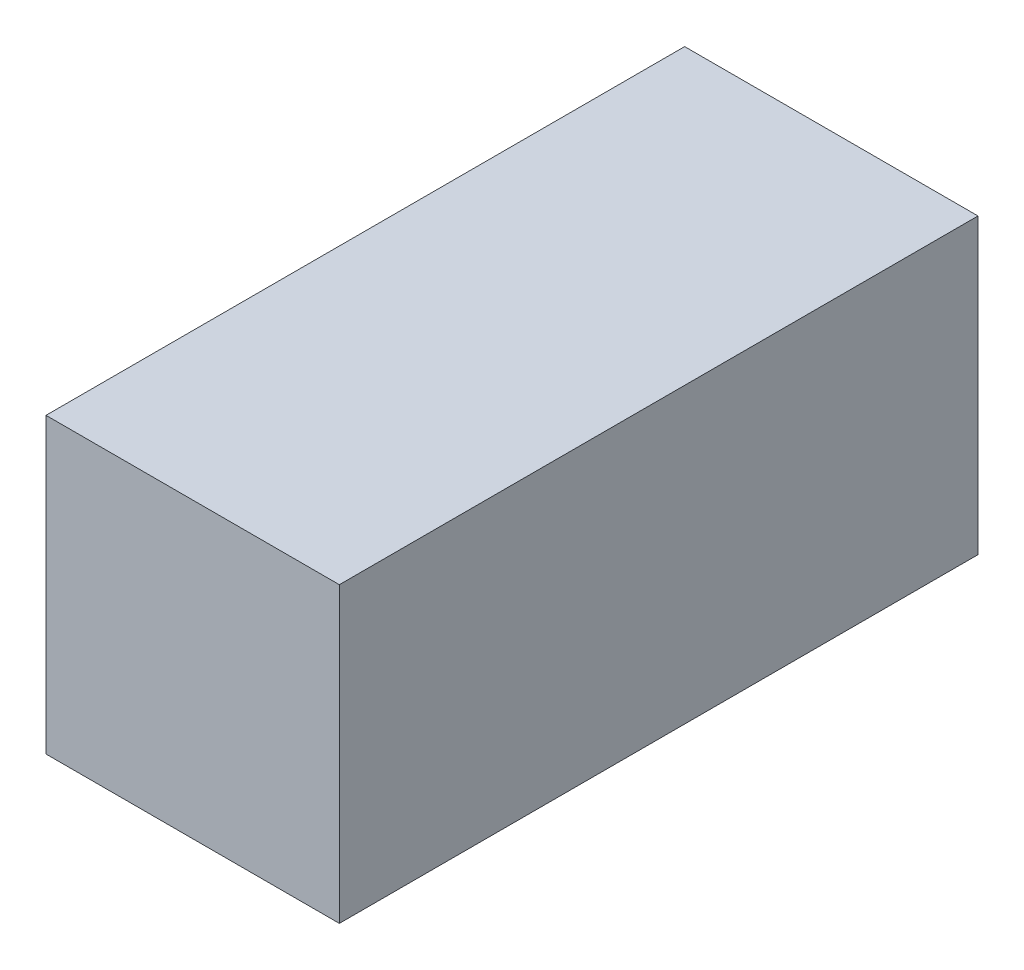
ISO-10303-21;
HEADER;
FILE_DESCRIPTION(('STEP AP214'),'2;1');
FILE_NAME('part.step','',(''),(''),'','','');
FILE_SCHEMA(('AUTOMOTIVE_DESIGN { 1 0 10303 214 1 1 1 1 }'));
ENDSEC;
DATA;
#1=APPLICATION_CONTEXT('core data for automotive mechanical design processes');
#2=APPLICATION_PROTOCOL_DEFINITION('international standard','automotive_design',2000,#1);
#3=PRODUCT_CONTEXT('',#1,'mechanical');
#4=PRODUCT('Part','Part','',(#3));
#5=PRODUCT_RELATED_PRODUCT_CATEGORY('part','',(#4));
#6=PRODUCT_DEFINITION_FORMATION('','',#4);
#7=PRODUCT_DEFINITION_CONTEXT('part definition',#1,'design');
#8=PRODUCT_DEFINITION('design','',#6,#7);
#9=PRODUCT_DEFINITION_SHAPE('','',#8);
#10=(LENGTH_UNIT() NAMED_UNIT(*) SI_UNIT(.MILLI.,.METRE.));
#11=(NAMED_UNIT(*) PLANE_ANGLE_UNIT() SI_UNIT($,.RADIAN.));
#12=(NAMED_UNIT(*) SI_UNIT($,.STERADIAN.) SOLID_ANGLE_UNIT());
#13=UNCERTAINTY_MEASURE_WITH_UNIT(LENGTH_MEASURE(1.E-05),#10,'distance_accuracy_value','');
#14=(GEOMETRIC_REPRESENTATION_CONTEXT(3) GLOBAL_UNCERTAINTY_ASSIGNED_CONTEXT((#13)) GLOBAL_UNIT_ASSIGNED_CONTEXT((#10,
#11,#12)) REPRESENTATION_CONTEXT('',''));
#15=CARTESIAN_POINT('',(0.,0.,0.));
#16=DIRECTION('',(0.,0.,1.));
#17=DIRECTION('',(1.,0.,0.));
#18=AXIS2_PLACEMENT_3D('',#15,#16,#17);
#19=CARTESIAN_POINT('',(0.,0.,76.2));
#20=DIRECTION('',(1.,0.,0.));
#21=DIRECTION('',(0.,1.,0.));
#22=AXIS2_PLACEMENT_3D('',#19,#20,#21);
#23=PLANE('',#22);
#24=DIRECTION('',(0.,-1.,0.));
#25=VECTOR('',#24,1.);
#26=CARTESIAN_POINT('',(0.,0.,0.));
#27=LINE('',#26,#25);
#28=CARTESIAN_POINT('',(0.,35.,0.));
#29=VERTEX_POINT('',#28);
#30=CARTESIAN_POINT('',(0.,0.,0.));
#31=VERTEX_POINT('',#30);
#32=EDGE_CURVE('E96',#29,#31,#27,.T.);
#33=ORIENTED_EDGE('',*,*,#32,.T.);
#34=DIRECTION('',(0.,0.,-1.));
#35=VECTOR('',#34,1.);
#36=CARTESIAN_POINT('',(0.,0.,76.2));
#37=LINE('',#36,#35);
#38=CARTESIAN_POINT('',(0.,0.,76.2));
#39=VERTEX_POINT('',#38);
#40=EDGE_CURVE('E11',#39,#31,#37,.T.);
#41=ORIENTED_EDGE('',*,*,#40,.F.);
#42=DIRECTION('',(0.,-1.,0.));
#43=VECTOR('',#42,1.);
#44=CARTESIAN_POINT('',(0.,0.,76.2));
#45=LINE('',#44,#43);
#46=CARTESIAN_POINT('',(0.,35.,76.2));
#47=VERTEX_POINT('',#46);
#48=EDGE_CURVE('E84',#47,#39,#45,.T.);
#49=ORIENTED_EDGE('',*,*,#48,.F.);
#50=DIRECTION('',(0.,0.,-1.));
#51=VECTOR('',#50,1.);
#52=CARTESIAN_POINT('',(0.,35.,76.2));
#53=LINE('',#52,#51);
#54=EDGE_CURVE('E92',#47,#29,#53,.T.);
#55=ORIENTED_EDGE('',*,*,#54,.T.);
#56=EDGE_LOOP('',(#33,#41,#49,#55));
#57=FACE_BOUND('',#56,.T.);
#58=ADVANCED_FACE('F33',(#57),#23,.F.);
#59=CARTESIAN_POINT('',(0.,0.,76.2));
#60=DIRECTION('',(0.,1.,0.));
#61=DIRECTION('',(0.,0.,1.));
#62=AXIS2_PLACEMENT_3D('',#59,#60,#61);
#63=PLANE('',#62);
#64=DIRECTION('',(1.,0.,0.));
#65=VECTOR('',#64,1.);
#66=CARTESIAN_POINT('',(0.,0.,0.));
#67=LINE('',#66,#65);
#68=CARTESIAN_POINT('',(35.,0.,0.));
#69=VERTEX_POINT('',#68);
#70=EDGE_CURVE('E88',#31,#69,#67,.T.);
#71=ORIENTED_EDGE('',*,*,#70,.T.);
#72=DIRECTION('',(0.,0.,-1.));
#73=VECTOR('',#72,1.);
#74=CARTESIAN_POINT('',(35.,0.,76.2));
#75=LINE('',#74,#73);
#76=CARTESIAN_POINT('',(35.,0.,76.2));
#77=VERTEX_POINT('',#76);
#78=EDGE_CURVE('E41',#77,#69,#75,.T.);
#79=ORIENTED_EDGE('',*,*,#78,.F.);
#80=DIRECTION('',(1.,0.,0.));
#81=VECTOR('',#80,1.);
#82=CARTESIAN_POINT('',(0.,0.,76.2));
#83=LINE('',#82,#81);
#84=EDGE_CURVE('E79',#39,#77,#83,.T.);
#85=ORIENTED_EDGE('',*,*,#84,.F.);
#86=ORIENTED_EDGE('',*,*,#40,.T.);
#87=EDGE_LOOP('',(#71,#79,#85,#86));
#88=FACE_BOUND('',#87,.T.);
#89=ADVANCED_FACE('F87',(#88),#63,.F.);
#90=CARTESIAN_POINT('',(35.,0.,76.2));
#91=DIRECTION('',(-1.,0.,0.));
#92=DIRECTION('',(0.,-1.,0.));
#93=AXIS2_PLACEMENT_3D('',#90,#91,#92);
#94=PLANE('',#93);
#95=DIRECTION('',(0.,1.,0.));
#96=VECTOR('',#95,1.);
#97=CARTESIAN_POINT('',(35.,0.,0.));
#98=LINE('',#97,#96);
#99=CARTESIAN_POINT('',(35.,35.,0.));
#100=VERTEX_POINT('',#99);
#101=EDGE_CURVE('E66',#69,#100,#98,.T.);
#102=ORIENTED_EDGE('',*,*,#101,.T.);
#103=DIRECTION('',(0.,0.,-1.));
#104=VECTOR('',#103,1.);
#105=CARTESIAN_POINT('',(35.,35.,76.2));
#106=LINE('',#105,#104);
#107=CARTESIAN_POINT('',(35.,35.,76.2));
#108=VERTEX_POINT('',#107);
#109=EDGE_CURVE('E89',#108,#100,#106,.T.);
#110=ORIENTED_EDGE('',*,*,#109,.F.);
#111=DIRECTION('',(0.,1.,0.));
#112=VECTOR('',#111,1.);
#113=CARTESIAN_POINT('',(35.,0.,76.2));
#114=LINE('',#113,#112);
#115=EDGE_CURVE('E82',#77,#108,#114,.T.);
#116=ORIENTED_EDGE('',*,*,#115,.F.);
#117=ORIENTED_EDGE('',*,*,#78,.T.);
#118=EDGE_LOOP('',(#102,#110,#116,#117));
#119=FACE_BOUND('',#118,.T.);
#120=ADVANCED_FACE('F90',(#119),#94,.F.);
#121=CARTESIAN_POINT('',(0.,35.,76.2));
#122=DIRECTION('',(0.,-1.,0.));
#123=DIRECTION('',(0.,0.,-1.));
#124=AXIS2_PLACEMENT_3D('',#121,#122,#123);
#125=PLANE('',#124);
#126=DIRECTION('',(-1.,0.,0.));
#127=VECTOR('',#126,1.);
#128=CARTESIAN_POINT('',(0.,35.,0.));
#129=LINE('',#128,#127);
#130=EDGE_CURVE('E72',#100,#29,#129,.T.);
#131=ORIENTED_EDGE('',*,*,#130,.T.);
#132=ORIENTED_EDGE('',*,*,#54,.F.);
#133=DIRECTION('',(-1.,0.,0.));
#134=VECTOR('',#133,1.);
#135=CARTESIAN_POINT('',(0.,35.,76.2));
#136=LINE('',#135,#134);
#137=EDGE_CURVE('E49',#108,#47,#136,.T.);
#138=ORIENTED_EDGE('',*,*,#137,.F.);
#139=ORIENTED_EDGE('',*,*,#109,.T.);
#140=EDGE_LOOP('',(#131,#132,#138,#139));
#141=FACE_BOUND('',#140,.T.);
#142=ADVANCED_FACE('F103',(#141),#125,.F.);
#143=CARTESIAN_POINT('',(0.,0.,76.2));
#144=DIRECTION('',(0.,0.,-1.));
#145=DIRECTION('',(-1.,0.,0.));
#146=AXIS2_PLACEMENT_3D('',#143,#144,#145);
#147=PLANE('',#146);
#148=ORIENTED_EDGE('',*,*,#48,.T.);
#149=ORIENTED_EDGE('',*,*,#84,.T.);
#150=ORIENTED_EDGE('',*,*,#115,.T.);
#151=ORIENTED_EDGE('',*,*,#137,.T.);
#152=EDGE_LOOP('',(#148,#149,#150,#151));
#153=FACE_BOUND('',#152,.T.);
#154=ADVANCED_FACE('F80',(#153),#147,.F.);
#155=CARTESIAN_POINT('',(0.,0.,0.));
#156=DIRECTION('',(0.,0.,-1.));
#157=DIRECTION('',(-1.,0.,0.));
#158=AXIS2_PLACEMENT_3D('',#155,#156,#157);
#159=PLANE('',#158);
#160=ORIENTED_EDGE('',*,*,#32,.F.);
#161=ORIENTED_EDGE('',*,*,#130,.F.);
#162=ORIENTED_EDGE('',*,*,#101,.F.);
#163=ORIENTED_EDGE('',*,*,#70,.F.);
#164=EDGE_LOOP('',(#160,#161,#162,#163));
#165=FACE_BOUND('',#164,.T.);
#166=ADVANCED_FACE('F106',(#165),#159,.T.);
#167=CLOSED_SHELL('',(#58,#89,#120,#142,#154,#166));
#168=MANIFOLD_SOLID_BREP('B2',#167);
#169=ADVANCED_BREP_SHAPE_REPRESENTATION('',(#18,#168),#14);
#170=SHAPE_DEFINITION_REPRESENTATION(#9,#169);
ENDSEC;
END-ISO-10303-21;
